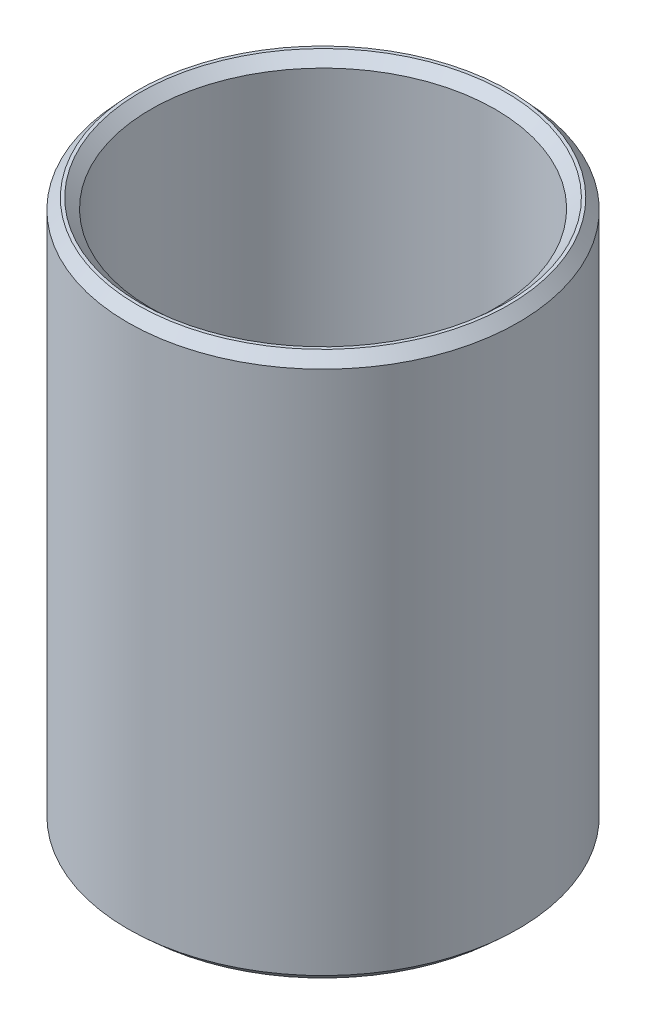
ISO-10303-21;
HEADER;
FILE_DESCRIPTION(('STEP AP214'),'2;1');
FILE_NAME('part.step','',(''),(''),'','','');
FILE_SCHEMA(('AUTOMOTIVE_DESIGN { 1 0 10303 214 1 1 1 1 }'));
ENDSEC;
DATA;
#1=APPLICATION_CONTEXT('core data for automotive mechanical design processes');
#2=APPLICATION_PROTOCOL_DEFINITION('international standard','automotive_design',2000,#1);
#3=PRODUCT_CONTEXT('',#1,'mechanical');
#4=PRODUCT('Part','Part','',(#3));
#5=PRODUCT_RELATED_PRODUCT_CATEGORY('part','',(#4));
#6=PRODUCT_DEFINITION_FORMATION('','',#4);
#7=PRODUCT_DEFINITION_CONTEXT('part definition',#1,'design');
#8=PRODUCT_DEFINITION('design','',#6,#7);
#9=PRODUCT_DEFINITION_SHAPE('','',#8);
#10=(LENGTH_UNIT() NAMED_UNIT(*) SI_UNIT(.MILLI.,.METRE.));
#11=(NAMED_UNIT(*) PLANE_ANGLE_UNIT() SI_UNIT($,.RADIAN.));
#12=(NAMED_UNIT(*) SI_UNIT($,.STERADIAN.) SOLID_ANGLE_UNIT());
#13=UNCERTAINTY_MEASURE_WITH_UNIT(LENGTH_MEASURE(1.E-05),#10,'distance_accuracy_value','');
#14=(GEOMETRIC_REPRESENTATION_CONTEXT(3) GLOBAL_UNCERTAINTY_ASSIGNED_CONTEXT((#13)) GLOBAL_UNIT_ASSIGNED_CONTEXT((#10,
#11,#12)) REPRESENTATION_CONTEXT('',''));
#15=CARTESIAN_POINT('',(0.,0.,0.));
#16=DIRECTION('',(0.,0.,1.));
#17=DIRECTION('',(1.,0.,0.));
#18=AXIS2_PLACEMENT_3D('',#15,#16,#17);
#19=CARTESIAN_POINT('',(0.,160.480718189216,0.));
#20=DIRECTION('',(0.,-1.,0.));
#21=DIRECTION('',(0.,0.,-1.));
#22=AXIS2_PLACEMENT_3D('',#19,#20,#21);
#23=CYLINDRICAL_SURFACE('',#22,57.5);
#24=CARTESIAN_POINT('',(0.,2.80526210562726,0.));
#25=DIRECTION('',(0.,1.,0.));
#26=DIRECTION('',(0.,0.,1.));
#27=AXIS2_PLACEMENT_3D('',#24,#25,#26);
#28=CIRCLE('',#27,57.5);
#29=CARTESIAN_POINT('',(0.,2.80526210562726,57.5));
#30=VERTEX_POINT('',#29);
#31=EDGE_CURVE('E10',#30,#30,#28,.T.);
#32=ORIENTED_EDGE('',*,*,#31,.T.);
#33=EDGE_LOOP('',(#32));
#34=FACE_BOUND('',#33,.T.);
#35=CARTESIAN_POINT('',(0.,157.404372948481,0.));
#36=DIRECTION('',(0.,1.,0.));
#37=DIRECTION('',(0.,0.,1.));
#38=AXIS2_PLACEMENT_3D('',#35,#36,#37);
#39=CIRCLE('',#38,57.5);
#40=CARTESIAN_POINT('',(0.,157.404372948481,57.5));
#41=VERTEX_POINT('',#40);
#42=EDGE_CURVE('E50',#41,#41,#39,.F.);
#43=ORIENTED_EDGE('',*,*,#42,.T.);
#44=EDGE_LOOP('',(#43));
#45=FACE_BOUND('',#44,.T.);
#46=ADVANCED_FACE('F39',(#34,#45),#23,.T.);
#47=CARTESIAN_POINT('',(0.,160.480718189216,0.));
#48=DIRECTION('',(0.,1.,0.));
#49=DIRECTION('',(0.,0.,1.));
#50=AXIS2_PLACEMENT_3D('',#47,#48,#49);
#51=PLANE('',#50);
#52=CARTESIAN_POINT('',(0.,160.480718189216,0.));
#53=DIRECTION('',(0.,1.,0.));
#54=DIRECTION('',(0.,0.,1.));
#55=AXIS2_PLACEMENT_3D('',#52,#53,#54);
#56=CIRCLE('',#55,53.7813903879947);
#57=CARTESIAN_POINT('',(0.,160.480718189216,53.7813903879947));
#58=VERTEX_POINT('',#57);
#59=EDGE_CURVE('E58',#58,#58,#56,.F.);
#60=ORIENTED_EDGE('',*,*,#59,.T.);
#61=EDGE_LOOP('',(#60));
#62=FACE_BOUND('',#61,.T.);
#63=CARTESIAN_POINT('',(0.,160.480718189216,0.));
#64=DIRECTION('',(0.,1.,0.));
#65=DIRECTION('',(0.,0.,1.));
#66=AXIS2_PLACEMENT_3D('',#63,#64,#65);
#67=CIRCLE('',#66,54.6947378943728);
#68=CARTESIAN_POINT('',(0.,160.480718189216,54.6947378943728));
#69=VERTEX_POINT('',#68);
#70=EDGE_CURVE('E61',#69,#69,#67,.T.);
#71=ORIENTED_EDGE('',*,*,#70,.T.);
#72=EDGE_LOOP('',(#71));
#73=FACE_BOUND('',#72,.T.);
#74=ADVANCED_FACE('F88',(#62,#73),#51,.T.);
#75=CARTESIAN_POINT('',(0.,0.,0.));
#76=DIRECTION('',(0.,1.,0.));
#77=DIRECTION('',(0.,0.,1.));
#78=AXIS2_PLACEMENT_3D('',#75,#76,#77);
#79=PLANE('',#78);
#80=CARTESIAN_POINT('',(0.,0.,0.));
#81=DIRECTION('',(0.,1.,0.));
#82=DIRECTION('',(0.,0.,1.));
#83=AXIS2_PLACEMENT_3D('',#80,#81,#82);
#84=CIRCLE('',#83,53.5103072528868);
#85=CARTESIAN_POINT('',(0.,0.,53.5103072528868));
#86=VERTEX_POINT('',#85);
#87=EDGE_CURVE('E51',#86,#86,#84,.T.);
#88=ORIENTED_EDGE('',*,*,#87,.T.);
#89=EDGE_LOOP('',(#88));
#90=FACE_BOUND('',#89,.T.);
#91=CARTESIAN_POINT('',(0.,0.,0.));
#92=DIRECTION('',(0.,1.,0.));
#93=DIRECTION('',(0.,0.,1.));
#94=AXIS2_PLACEMENT_3D('',#91,#92,#93);
#95=CIRCLE('',#94,54.4236547592647);
#96=CARTESIAN_POINT('',(0.,0.,54.4236547592647));
#97=VERTEX_POINT('',#96);
#98=EDGE_CURVE('E54',#97,#97,#95,.F.);
#99=ORIENTED_EDGE('',*,*,#98,.T.);
#100=EDGE_LOOP('',(#99));
#101=FACE_BOUND('',#100,.T.);
#102=ADVANCED_FACE('F83',(#90,#101),#79,.F.);
#103=CARTESIAN_POINT('',(0.,160.480718189216,0.));
#104=DIRECTION('',(0.,-1.,0.));
#105=DIRECTION('',(0.,0.,-1.));
#106=AXIS2_PLACEMENT_3D('',#103,#104,#105);
#107=CYLINDRICAL_SURFACE('',#106,50.7050451472595);
#108=CARTESIAN_POINT('',(0.,157.675456083589,0.));
#109=DIRECTION('',(0.,1.,0.));
#110=DIRECTION('',(0.,0.,1.));
#111=AXIS2_PLACEMENT_3D('',#108,#109,#110);
#112=CIRCLE('',#111,50.7050451472595);
#113=CARTESIAN_POINT('',(0.,157.675456083589,50.7050451472595));
#114=VERTEX_POINT('',#113);
#115=EDGE_CURVE('E67',#114,#114,#112,.T.);
#116=ORIENTED_EDGE('',*,*,#115,.T.);
#117=EDGE_LOOP('',(#116));
#118=FACE_BOUND('',#117,.T.);
#119=CARTESIAN_POINT('',(0.,3.07634524073536,0.));
#120=DIRECTION('',(0.,1.,0.));
#121=DIRECTION('',(0.,0.,1.));
#122=AXIS2_PLACEMENT_3D('',#119,#120,#121);
#123=CIRCLE('',#122,50.7050451472595);
#124=CARTESIAN_POINT('',(0.,3.07634524073536,50.7050451472595));
#125=VERTEX_POINT('',#124);
#126=EDGE_CURVE('E69',#125,#125,#123,.F.);
#127=ORIENTED_EDGE('',*,*,#126,.T.);
#128=EDGE_LOOP('',(#127));
#129=FACE_BOUND('',#128,.T.);
#130=ADVANCED_FACE('F71',(#118,#129),#107,.F.);
#131=CARTESIAN_POINT('',(0.,157.675456083589,0.));
#132=DIRECTION('',(0.,1.,0.));
#133=DIRECTION('',(0.,0.,1.));
#134=AXIS2_PLACEMENT_3D('',#131,#132,#133);
#135=CONICAL_SURFACE('',#134,50.7050451472595,0.831455543762787);
#136=ORIENTED_EDGE('',*,*,#59,.F.);
#137=EDGE_LOOP('',(#136));
#138=FACE_BOUND('',#137,.T.);
#139=ORIENTED_EDGE('',*,*,#115,.F.);
#140=EDGE_LOOP('',(#139));
#141=FACE_BOUND('',#140,.T.);
#142=ADVANCED_FACE('F77',(#138,#141),#135,.F.);
#143=CARTESIAN_POINT('',(0.,0.,0.));
#144=DIRECTION('',(0.,-1.,0.));
#145=DIRECTION('',(0.,0.,-1.));
#146=AXIS2_PLACEMENT_3D('',#143,#144,#145);
#147=CONICAL_SURFACE('',#146,53.5103072528868,0.7393407830321);
#148=ORIENTED_EDGE('',*,*,#126,.F.);
#149=EDGE_LOOP('',(#148));
#150=FACE_BOUND('',#149,.T.);
#151=ORIENTED_EDGE('',*,*,#87,.F.);
#152=EDGE_LOOP('',(#151));
#153=FACE_BOUND('',#152,.T.);
#154=ADVANCED_FACE('F73',(#150,#153),#147,.F.);
#155=CARTESIAN_POINT('',(0.,2.80526210562726,0.));
#156=DIRECTION('',(0.,1.,0.));
#157=DIRECTION('',(0.,0.,1.));
#158=AXIS2_PLACEMENT_3D('',#155,#156,#157);
#159=CONICAL_SURFACE('',#158,57.5,0.831455543762794);
#160=ORIENTED_EDGE('',*,*,#98,.F.);
#161=EDGE_LOOP('',(#160));
#162=FACE_BOUND('',#161,.T.);
#163=ORIENTED_EDGE('',*,*,#31,.F.);
#164=EDGE_LOOP('',(#163));
#165=FACE_BOUND('',#164,.T.);
#166=ADVANCED_FACE('F76',(#162,#165),#159,.T.);
#167=CARTESIAN_POINT('',(0.,160.480718189216,0.));
#168=DIRECTION('',(0.,-1.,0.));
#169=DIRECTION('',(0.,0.,-1.));
#170=AXIS2_PLACEMENT_3D('',#167,#168,#169);
#171=CONICAL_SURFACE('',#170,54.6947378943728,0.739340783032104);
#172=ORIENTED_EDGE('',*,*,#42,.F.);
#173=EDGE_LOOP('',(#172));
#174=FACE_BOUND('',#173,.T.);
#175=ORIENTED_EDGE('',*,*,#70,.F.);
#176=EDGE_LOOP('',(#175));
#177=FACE_BOUND('',#176,.T.);
#178=ADVANCED_FACE('F45',(#174,#177),#171,.T.);
#179=CLOSED_SHELL('',(#46,#74,#102,#130,#142,#154,#166,#178));
#180=MANIFOLD_SOLID_BREP('B2',#179);
#181=ADVANCED_BREP_SHAPE_REPRESENTATION('',(#18,#180),#14);
#182=SHAPE_DEFINITION_REPRESENTATION(#9,#181);
ENDSEC;
END-ISO-10303-21;
